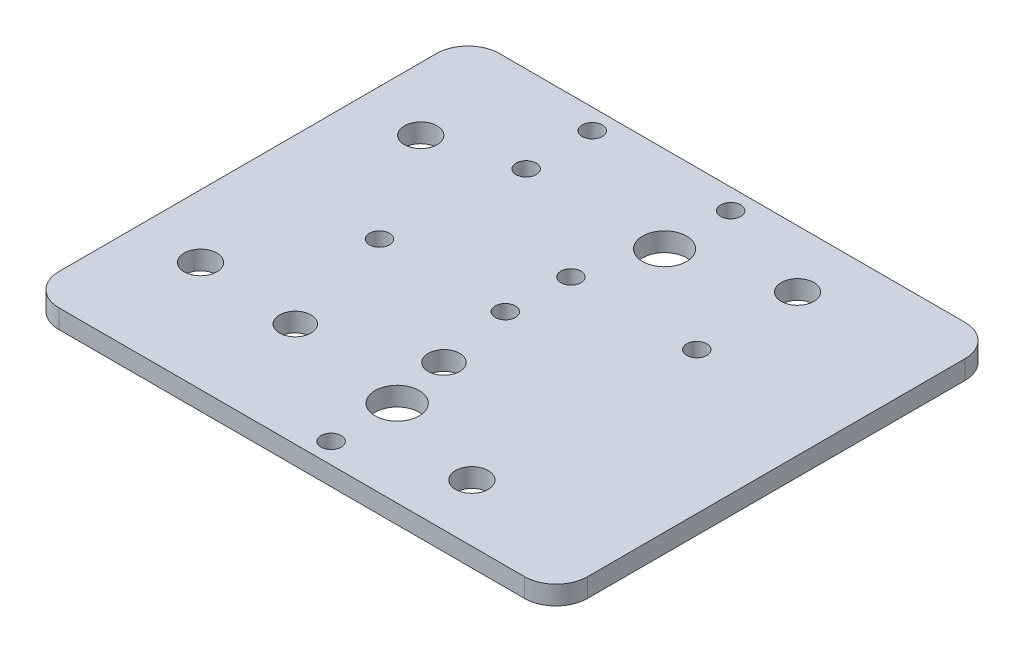
ISO-10303-21;
HEADER;
FILE_DESCRIPTION(('STEP AP214'),'2;1');
FILE_NAME('part.step','',(''),(''),'','','');
FILE_SCHEMA(('AUTOMOTIVE_DESIGN { 1 0 10303 214 1 1 1 1 }'));
ENDSEC;
DATA;
#1=APPLICATION_CONTEXT('core data for automotive mechanical design processes');
#2=APPLICATION_PROTOCOL_DEFINITION('international standard','automotive_design',2000,#1);
#3=PRODUCT_CONTEXT('',#1,'mechanical');
#4=PRODUCT('Part','Part','',(#3));
#5=PRODUCT_RELATED_PRODUCT_CATEGORY('part','',(#4));
#6=PRODUCT_DEFINITION_FORMATION('','',#4);
#7=PRODUCT_DEFINITION_CONTEXT('part definition',#1,'design');
#8=PRODUCT_DEFINITION('design','',#6,#7);
#9=PRODUCT_DEFINITION_SHAPE('','',#8);
#10=(LENGTH_UNIT() NAMED_UNIT(*) SI_UNIT(.MILLI.,.METRE.));
#11=(NAMED_UNIT(*) PLANE_ANGLE_UNIT() SI_UNIT($,.RADIAN.));
#12=(NAMED_UNIT(*) SI_UNIT($,.STERADIAN.) SOLID_ANGLE_UNIT());
#13=UNCERTAINTY_MEASURE_WITH_UNIT(LENGTH_MEASURE(1.E-05),#10,'distance_accuracy_value','');
#14=(GEOMETRIC_REPRESENTATION_CONTEXT(3) GLOBAL_UNCERTAINTY_ASSIGNED_CONTEXT((#13)) GLOBAL_UNIT_ASSIGNED_CONTEXT((#10,
#11,#12)) REPRESENTATION_CONTEXT('',''));
#15=CARTESIAN_POINT('',(0.,0.,0.));
#16=DIRECTION('',(0.,0.,1.));
#17=DIRECTION('',(1.,0.,0.));
#18=AXIS2_PLACEMENT_3D('',#15,#16,#17);
#19=CARTESIAN_POINT('',(0.,3.,0.));
#20=DIRECTION('',(0.,-1.,0.));
#21=DIRECTION('',(0.,0.,-1.));
#22=AXIS2_PLACEMENT_3D('',#19,#20,#21);
#23=PLANE('',#22);
#24=CARTESIAN_POINT('',(-25.5000000002138,3.,0.0647945311920816));
#25=DIRECTION('',(0.,1.,0.));
#26=DIRECTION('',(0.,0.,1.));
#27=AXIS2_PLACEMENT_3D('',#24,#25,#26);
#28=CIRCLE('',#27,1.6);
#29=CARTESIAN_POINT('',(-25.5000000002138,3.,1.66479453119208));
#30=VERTEX_POINT('',#29);
#31=EDGE_CURVE('E317',#30,#30,#28,.T.);
#32=ORIENTED_EDGE('',*,*,#31,.F.);
#33=EDGE_LOOP('',(#32));
#34=FACE_BOUND('',#33,.T.);
#35=CARTESIAN_POINT('',(-25.066035849547,3.,-9.93520546880806));
#36=DIRECTION('',(0.,1.,0.));
#37=DIRECTION('',(0.,0.,1.));
#38=AXIS2_PLACEMENT_3D('',#35,#36,#37);
#39=CIRCLE('',#38,1.6);
#40=CARTESIAN_POINT('',(-25.066035849547,3.,-8.33520546880806));
#41=VERTEX_POINT('',#40);
#42=EDGE_CURVE('E311',#41,#41,#39,.T.);
#43=ORIENTED_EDGE('',*,*,#42,.F.);
#44=EDGE_LOOP('',(#43));
#45=FACE_BOUND('',#44,.T.);
#46=CARTESIAN_POINT('',(-5.00000000019241,3.,25.8790553609461));
#47=DIRECTION('',(0.,1.,0.));
#48=DIRECTION('',(0.,0.,1.));
#49=AXIS2_PLACEMENT_3D('',#46,#47,#48);
#50=CIRCLE('',#49,2.6);
#51=CARTESIAN_POINT('',(-5.00000000019241,3.,28.4790553609461));
#52=VERTEX_POINT('',#51);
#53=EDGE_CURVE('E305',#52,#52,#50,.T.);
#54=ORIENTED_EDGE('',*,*,#53,.F.);
#55=EDGE_LOOP('',(#54));
#56=FACE_BOUND('',#55,.T.);
#57=CARTESIAN_POINT('',(-5.06603584954699,3.,-9.93520546880806));
#58=DIRECTION('',(0.,1.,0.));
#59=DIRECTION('',(0.,0.,1.));
#60=AXIS2_PLACEMENT_3D('',#57,#58,#59);
#61=CIRCLE('',#60,1.6);
#62=CARTESIAN_POINT('',(-5.06603584954699,3.,-8.33520546880806));
#63=VERTEX_POINT('',#62);
#64=EDGE_CURVE('E298',#63,#63,#61,.T.);
#65=ORIENTED_EDGE('',*,*,#64,.F.);
#66=EDGE_LOOP('',(#65));
#67=FACE_BOUND('',#66,.T.);
#68=CARTESIAN_POINT('',(-56.5,3.,-17.5000000000001));
#69=DIRECTION('',(0.,1.,0.));
#70=DIRECTION('',(0.,0.,1.));
#71=AXIS2_PLACEMENT_3D('',#68,#69,#70);
#72=CIRCLE('',#71,2.6);
#73=CARTESIAN_POINT('',(-56.5,3.,-14.9000000000001));
#74=VERTEX_POINT('',#73);
#75=EDGE_CURVE('E334',#74,#74,#72,.T.);
#76=ORIENTED_EDGE('',*,*,#75,.F.);
#77=EDGE_LOOP('',(#76));
#78=FACE_BOUND('',#77,.T.);
#79=CARTESIAN_POINT('',(-5.00000000019241,3.,-25.8790553609461));
#80=DIRECTION('',(0.,1.,0.));
#81=DIRECTION('',(0.,0.,1.));
#82=AXIS2_PLACEMENT_3D('',#79,#80,#81);
#83=CIRCLE('',#82,2.6);
#84=CARTESIAN_POINT('',(-5.00000000019241,3.,-23.2790553609461));
#85=VERTEX_POINT('',#84);
#86=EDGE_CURVE('E328',#85,#85,#83,.T.);
#87=ORIENTED_EDGE('',*,*,#86,.F.);
#88=EDGE_LOOP('',(#87));
#89=FACE_BOUND('',#88,.T.);
#90=CARTESIAN_POINT('',(-56.5,3.,17.5000000000001));
#91=DIRECTION('',(0.,1.,0.));
#92=DIRECTION('',(0.,0.,1.));
#93=AXIS2_PLACEMENT_3D('',#90,#91,#92);
#94=CIRCLE('',#93,2.6);
#95=CARTESIAN_POINT('',(-56.5,3.,20.1000000000001));
#96=VERTEX_POINT('',#95);
#97=EDGE_CURVE('E322',#96,#96,#94,.T.);
#98=ORIENTED_EDGE('',*,*,#97,.F.);
#99=EDGE_LOOP('',(#98));
#100=FACE_BOUND('',#99,.T.);
#101=CARTESIAN_POINT('',(-45.5000000002138,3.,0.064794531192105));
#102=DIRECTION('',(0.,1.,0.));
#103=DIRECTION('',(0.,0.,1.));
#104=AXIS2_PLACEMENT_3D('',#101,#102,#103);
#105=CIRCLE('',#104,1.6);
#106=CARTESIAN_POINT('',(-45.5000000002138,3.,1.6647945311921));
#107=VERTEX_POINT('',#106);
#108=EDGE_CURVE('E292',#107,#107,#105,.T.);
#109=ORIENTED_EDGE('',*,*,#108,.F.);
#110=EDGE_LOOP('',(#109));
#111=FACE_BOUND('',#110,.T.);
#112=CARTESIAN_POINT('',(-40.5000000000026,3.,18.4480525361965));
#113=DIRECTION('',(0.,1.,0.));
#114=DIRECTION('',(0.,0.,1.));
#115=AXIS2_PLACEMENT_3D('',#112,#113,#114);
#116=CIRCLE('',#115,2.49999999996961);
#117=CARTESIAN_POINT('',(-40.5000000000026,3.,20.9480525361661));
#118=VERTEX_POINT('',#117);
#119=EDGE_CURVE('E286',#118,#118,#116,.T.);
#120=ORIENTED_EDGE('',*,*,#119,.F.);
#121=EDGE_LOOP('',(#120));
#122=FACE_BOUND('',#121,.T.);
#123=CARTESIAN_POINT('',(-23.3936515938965,3.,11.9198305394652));
#124=DIRECTION('',(0.,1.,0.));
#125=DIRECTION('',(0.,0.,1.));
#126=AXIS2_PLACEMENT_3D('',#123,#124,#125);
#127=CIRCLE('',#126,2.5);
#128=CARTESIAN_POINT('',(-23.3936515938965,3.,14.4198305394652));
#129=VERTEX_POINT('',#128);
#130=EDGE_CURVE('E280',#129,#129,#127,.T.);
#131=ORIENTED_EDGE('',*,*,#130,.F.);
#132=EDGE_LOOP('',(#131));
#133=FACE_BOUND('',#132,.T.);
#134=CARTESIAN_POINT('',(-21.5000000000002,3.,31.75));
#135=DIRECTION('',(0.,-1.,0.));
#136=DIRECTION('',(0.,0.,-1.));
#137=AXIS2_PLACEMENT_3D('',#134,#135,#136);
#138=CIRCLE('',#137,1.6);
#139=CARTESIAN_POINT('',(-21.5000000000002,3.,30.15));
#140=VERTEX_POINT('',#139);
#141=EDGE_CURVE('E171',#140,#140,#138,.T.);
#142=ORIENTED_EDGE('',*,*,#141,.T.);
#143=EDGE_LOOP('',(#142));
#144=FACE_BOUND('',#143,.T.);
#145=CARTESIAN_POINT('',(-43.5000000000002,3.,-21.25));
#146=DIRECTION('',(0.,-1.,0.));
#147=DIRECTION('',(0.,0.,1.));
#148=AXIS2_PLACEMENT_3D('',#145,#146,#147);
#149=CIRCLE('',#148,1.6);
#150=CARTESIAN_POINT('',(-43.5000000000002,3.,-19.65));
#151=VERTEX_POINT('',#150);
#152=EDGE_CURVE('E260',#151,#151,#149,.T.);
#153=ORIENTED_EDGE('',*,*,#152,.T.);
#154=EDGE_LOOP('',(#153));
#155=FACE_BOUND('',#154,.T.);
#156=CARTESIAN_POINT('',(-21.5000000000002,3.,-31.75));
#157=DIRECTION('',(0.,-1.,0.));
#158=DIRECTION('',(0.,0.,1.));
#159=AXIS2_PLACEMENT_3D('',#156,#157,#158);
#160=CIRCLE('',#159,1.6);
#161=CARTESIAN_POINT('',(-21.5000000000002,3.,-30.15));
#162=VERTEX_POINT('',#161);
#163=EDGE_CURVE('E246',#162,#162,#160,.T.);
#164=ORIENTED_EDGE('',*,*,#163,.T.);
#165=EDGE_LOOP('',(#164));
#166=FACE_BOUND('',#165,.T.);
#167=CARTESIAN_POINT('',(-21.5000000000002,3.,-21.25));
#168=DIRECTION('',(0.,-1.,0.));
#169=DIRECTION('',(0.,0.,1.));
#170=AXIS2_PLACEMENT_3D('',#167,#168,#169);
#171=CIRCLE('',#170,3.5);
#172=CARTESIAN_POINT('',(-21.5000000000002,3.,-17.75));
#173=VERTEX_POINT('',#172);
#174=EDGE_CURVE('E269',#173,#173,#171,.T.);
#175=ORIENTED_EDGE('',*,*,#174,.T.);
#176=EDGE_LOOP('',(#175));
#177=FACE_BOUND('',#176,.T.);
#178=CARTESIAN_POINT('',(-21.5000000000002,3.,21.25));
#179=DIRECTION('',(0.,-1.,0.));
#180=DIRECTION('',(0.,0.,-1.));
#181=AXIS2_PLACEMENT_3D('',#178,#179,#180);
#182=CIRCLE('',#181,3.5);
#183=CARTESIAN_POINT('',(-21.5000000000002,3.,17.75));
#184=VERTEX_POINT('',#183);
#185=EDGE_CURVE('E268',#184,#184,#182,.T.);
#186=ORIENTED_EDGE('',*,*,#185,.T.);
#187=EDGE_LOOP('',(#186));
#188=FACE_BOUND('',#187,.T.);
#189=CARTESIAN_POINT('',(-43.5000000000002,3.,-31.75));
#190=DIRECTION('',(0.,-1.,0.));
#191=DIRECTION('',(0.,0.,-1.));
#192=AXIS2_PLACEMENT_3D('',#189,#190,#191);
#193=CIRCLE('',#192,1.60000000000001);
#194=CARTESIAN_POINT('',(-43.5000000000002,3.,-33.35));
#195=VERTEX_POINT('',#194);
#196=EDGE_CURVE('E251',#195,#195,#193,.T.);
#197=ORIENTED_EDGE('',*,*,#196,.T.);
#198=EDGE_LOOP('',(#197));
#199=FACE_BOUND('',#198,.T.);
#200=DIRECTION('',(0.,0.,-1.));
#201=VECTOR('',#200,1.);
#202=CARTESIAN_POINT('',(17.5,3.,35.));
#203=LINE('',#202,#201);
#204=CARTESIAN_POINT('',(17.5,3.,30.));
#205=VERTEX_POINT('',#204);
#206=CARTESIAN_POINT('',(17.5,3.,-30.));
#207=VERTEX_POINT('',#206);
#208=EDGE_CURVE('E132',#205,#207,#203,.T.);
#209=ORIENTED_EDGE('',*,*,#208,.T.);
#210=CARTESIAN_POINT('',(12.5,3.,-30.));
#211=DIRECTION('',(0.,-1.,0.));
#212=DIRECTION('',(0.,0.,-1.));
#213=AXIS2_PLACEMENT_3D('',#210,#211,#212);
#214=CIRCLE('',#213,5.);
#215=CARTESIAN_POINT('',(12.5,3.,-35.));
#216=VERTEX_POINT('',#215);
#217=EDGE_CURVE('E152',#207,#216,#214,.F.);
#218=ORIENTED_EDGE('',*,*,#217,.T.);
#219=DIRECTION('',(-1.,0.,0.));
#220=VECTOR('',#219,1.);
#221=CARTESIAN_POINT('',(-17.5,3.,-35.));
#222=LINE('',#221,#220);
#223=CARTESIAN_POINT('',(-61.5,3.,-35.));
#224=VERTEX_POINT('',#223);
#225=EDGE_CURVE('E122',#216,#224,#222,.T.);
#226=ORIENTED_EDGE('',*,*,#225,.T.);
#227=CARTESIAN_POINT('',(-61.5,3.,-30.));
#228=DIRECTION('',(0.,-1.,0.));
#229=DIRECTION('',(0.,0.,-1.));
#230=AXIS2_PLACEMENT_3D('',#227,#228,#229);
#231=CIRCLE('',#230,5.);
#232=CARTESIAN_POINT('',(-66.5,3.,-30.));
#233=VERTEX_POINT('',#232);
#234=EDGE_CURVE('E150',#224,#233,#231,.F.);
#235=ORIENTED_EDGE('',*,*,#234,.T.);
#236=DIRECTION('',(0.,0.,1.));
#237=VECTOR('',#236,1.);
#238=CARTESIAN_POINT('',(-66.5,3.,35.));
#239=LINE('',#238,#237);
#240=CARTESIAN_POINT('',(-66.5,3.,30.));
#241=VERTEX_POINT('',#240);
#242=EDGE_CURVE('E168',#233,#241,#239,.T.);
#243=ORIENTED_EDGE('',*,*,#242,.T.);
#244=CARTESIAN_POINT('',(-61.5,3.,30.));
#245=DIRECTION('',(0.,-1.,0.));
#246=DIRECTION('',(0.,0.,-1.));
#247=AXIS2_PLACEMENT_3D('',#244,#245,#246);
#248=CIRCLE('',#247,5.);
#249=CARTESIAN_POINT('',(-61.5,3.,35.));
#250=VERTEX_POINT('',#249);
#251=EDGE_CURVE('E57',#241,#250,#248,.F.);
#252=ORIENTED_EDGE('',*,*,#251,.T.);
#253=DIRECTION('',(1.,0.,0.));
#254=VECTOR('',#253,1.);
#255=CARTESIAN_POINT('',(-17.5,3.,35.));
#256=LINE('',#255,#254);
#257=CARTESIAN_POINT('',(12.5,3.,35.));
#258=VERTEX_POINT('',#257);
#259=EDGE_CURVE('E138',#250,#258,#256,.T.);
#260=ORIENTED_EDGE('',*,*,#259,.T.);
#261=CARTESIAN_POINT('',(12.5,3.,30.));
#262=DIRECTION('',(0.,-1.,0.));
#263=DIRECTION('',(0.,0.,-1.));
#264=AXIS2_PLACEMENT_3D('',#261,#262,#263);
#265=CIRCLE('',#264,5.);
#266=EDGE_CURVE('E148',#258,#205,#265,.F.);
#267=ORIENTED_EDGE('',*,*,#266,.T.);
#268=EDGE_LOOP('',(#209,#218,#226,#235,#243,#252,#260,#267));
#269=FACE_BOUND('',#268,.T.);
#270=ADVANCED_FACE('F37',(#34,#45,#56,#67,#78,#89,#100,#111,#122,#133,#144,#155,#166,#177,#188,
#199,#269),#23,.F.);
#271=CARTESIAN_POINT('',(0.,0.,0.));
#272=DIRECTION('',(0.,-1.,0.));
#273=DIRECTION('',(0.,0.,-1.));
#274=AXIS2_PLACEMENT_3D('',#271,#272,#273);
#275=PLANE('',#274);
#276=CARTESIAN_POINT('',(-25.5000000002138,0.,0.0647945311920816));
#277=DIRECTION('',(0.,1.,0.));
#278=DIRECTION('',(0.,0.,1.));
#279=AXIS2_PLACEMENT_3D('',#276,#277,#278);
#280=CIRCLE('',#279,1.6);
#281=CARTESIAN_POINT('',(-25.5000000002138,0.,1.66479453119208));
#282=VERTEX_POINT('',#281);
#283=EDGE_CURVE('E295',#282,#282,#280,.T.);
#284=ORIENTED_EDGE('',*,*,#283,.T.);
#285=EDGE_LOOP('',(#284));
#286=FACE_BOUND('',#285,.T.);
#287=CARTESIAN_POINT('',(-25.066035849547,0.,-9.93520546880806));
#288=DIRECTION('',(0.,1.,0.));
#289=DIRECTION('',(0.,0.,1.));
#290=AXIS2_PLACEMENT_3D('',#287,#288,#289);
#291=CIRCLE('',#290,1.6);
#292=CARTESIAN_POINT('',(-25.066035849547,0.,-8.33520546880806));
#293=VERTEX_POINT('',#292);
#294=EDGE_CURVE('E314',#293,#293,#291,.T.);
#295=ORIENTED_EDGE('',*,*,#294,.T.);
#296=EDGE_LOOP('',(#295));
#297=FACE_BOUND('',#296,.T.);
#298=CARTESIAN_POINT('',(-5.00000000019241,0.,25.8790553609461));
#299=DIRECTION('',(0.,1.,0.));
#300=DIRECTION('',(0.,0.,1.));
#301=AXIS2_PLACEMENT_3D('',#298,#299,#300);
#302=CIRCLE('',#301,2.6);
#303=CARTESIAN_POINT('',(-5.00000000019241,0.,28.4790553609461));
#304=VERTEX_POINT('',#303);
#305=EDGE_CURVE('E308',#304,#304,#302,.T.);
#306=ORIENTED_EDGE('',*,*,#305,.T.);
#307=EDGE_LOOP('',(#306));
#308=FACE_BOUND('',#307,.T.);
#309=CARTESIAN_POINT('',(-5.06603584954699,0.,-9.93520546880806));
#310=DIRECTION('',(0.,1.,0.));
#311=DIRECTION('',(0.,0.,1.));
#312=AXIS2_PLACEMENT_3D('',#309,#310,#311);
#313=CIRCLE('',#312,1.6);
#314=CARTESIAN_POINT('',(-5.06603584954699,0.,-8.33520546880806));
#315=VERTEX_POINT('',#314);
#316=EDGE_CURVE('E301',#315,#315,#313,.T.);
#317=ORIENTED_EDGE('',*,*,#316,.T.);
#318=EDGE_LOOP('',(#317));
#319=FACE_BOUND('',#318,.T.);
#320=CARTESIAN_POINT('',(-56.5,0.,-17.5000000000001));
#321=DIRECTION('',(0.,1.,0.));
#322=DIRECTION('',(0.,0.,1.));
#323=AXIS2_PLACEMENT_3D('',#320,#321,#322);
#324=CIRCLE('',#323,2.6);
#325=CARTESIAN_POINT('',(-56.5,0.,-14.9000000000001));
#326=VERTEX_POINT('',#325);
#327=EDGE_CURVE('E302',#326,#326,#324,.T.);
#328=ORIENTED_EDGE('',*,*,#327,.T.);
#329=EDGE_LOOP('',(#328));
#330=FACE_BOUND('',#329,.T.);
#331=CARTESIAN_POINT('',(-5.00000000019241,0.,-25.8790553609461));
#332=DIRECTION('',(0.,1.,0.));
#333=DIRECTION('',(0.,0.,1.));
#334=AXIS2_PLACEMENT_3D('',#331,#332,#333);
#335=CIRCLE('',#334,2.6);
#336=CARTESIAN_POINT('',(-5.00000000019241,0.,-23.2790553609461));
#337=VERTEX_POINT('',#336);
#338=EDGE_CURVE('E331',#337,#337,#335,.T.);
#339=ORIENTED_EDGE('',*,*,#338,.T.);
#340=EDGE_LOOP('',(#339));
#341=FACE_BOUND('',#340,.T.);
#342=CARTESIAN_POINT('',(-56.5,0.,17.5000000000001));
#343=DIRECTION('',(0.,1.,0.));
#344=DIRECTION('',(0.,0.,1.));
#345=AXIS2_PLACEMENT_3D('',#342,#343,#344);
#346=CIRCLE('',#345,2.6);
#347=CARTESIAN_POINT('',(-56.5,0.,20.1000000000001));
#348=VERTEX_POINT('',#347);
#349=EDGE_CURVE('E325',#348,#348,#346,.T.);
#350=ORIENTED_EDGE('',*,*,#349,.T.);
#351=EDGE_LOOP('',(#350));
#352=FACE_BOUND('',#351,.T.);
#353=CARTESIAN_POINT('',(-45.5000000002138,0.,0.064794531192105));
#354=DIRECTION('',(0.,1.,0.));
#355=DIRECTION('',(0.,0.,1.));
#356=AXIS2_PLACEMENT_3D('',#353,#354,#355);
#357=CIRCLE('',#356,1.6);
#358=CARTESIAN_POINT('',(-45.5000000002138,0.,1.6647945311921));
#359=VERTEX_POINT('',#358);
#360=EDGE_CURVE('E289',#359,#359,#357,.T.);
#361=ORIENTED_EDGE('',*,*,#360,.T.);
#362=EDGE_LOOP('',(#361));
#363=FACE_BOUND('',#362,.T.);
#364=CARTESIAN_POINT('',(-40.5000000000026,0.,18.4480525361965));
#365=DIRECTION('',(0.,1.,0.));
#366=DIRECTION('',(0.,0.,1.));
#367=AXIS2_PLACEMENT_3D('',#364,#365,#366);
#368=CIRCLE('',#367,2.49999999996961);
#369=CARTESIAN_POINT('',(-40.5000000000026,0.,20.9480525361661));
#370=VERTEX_POINT('',#369);
#371=EDGE_CURVE('E283',#370,#370,#368,.T.);
#372=ORIENTED_EDGE('',*,*,#371,.T.);
#373=EDGE_LOOP('',(#372));
#374=FACE_BOUND('',#373,.T.);
#375=CARTESIAN_POINT('',(-23.3936515938965,0.,11.9198305394652));
#376=DIRECTION('',(0.,1.,0.));
#377=DIRECTION('',(0.,0.,1.));
#378=AXIS2_PLACEMENT_3D('',#375,#376,#377);
#379=CIRCLE('',#378,2.5);
#380=CARTESIAN_POINT('',(-23.3936515938965,0.,14.4198305394652));
#381=VERTEX_POINT('',#380);
#382=EDGE_CURVE('E277',#381,#381,#379,.T.);
#383=ORIENTED_EDGE('',*,*,#382,.T.);
#384=EDGE_LOOP('',(#383));
#385=FACE_BOUND('',#384,.T.);
#386=CARTESIAN_POINT('',(-21.5000000000002,0.,31.75));
#387=DIRECTION('',(0.,-1.,0.));
#388=DIRECTION('',(0.,0.,-1.));
#389=AXIS2_PLACEMENT_3D('',#386,#387,#388);
#390=CIRCLE('',#389,1.6);
#391=CARTESIAN_POINT('',(-21.5000000000002,0.,30.15));
#392=VERTEX_POINT('',#391);
#393=EDGE_CURVE('E175',#392,#392,#390,.T.);
#394=ORIENTED_EDGE('',*,*,#393,.F.);
#395=EDGE_LOOP('',(#394));
#396=FACE_BOUND('',#395,.T.);
#397=CARTESIAN_POINT('',(-43.5000000000002,0.,-21.25));
#398=DIRECTION('',(0.,-1.,0.));
#399=DIRECTION('',(0.,0.,1.));
#400=AXIS2_PLACEMENT_3D('',#397,#398,#399);
#401=CIRCLE('',#400,1.6);
#402=CARTESIAN_POINT('',(-43.5000000000002,0.,-19.65));
#403=VERTEX_POINT('',#402);
#404=EDGE_CURVE('E252',#403,#403,#401,.T.);
#405=ORIENTED_EDGE('',*,*,#404,.F.);
#406=EDGE_LOOP('',(#405));
#407=FACE_BOUND('',#406,.T.);
#408=CARTESIAN_POINT('',(-21.5000000000002,0.,-31.75));
#409=DIRECTION('',(0.,-1.,0.));
#410=DIRECTION('',(0.,0.,1.));
#411=AXIS2_PLACEMENT_3D('',#408,#409,#410);
#412=CIRCLE('',#411,1.6);
#413=CARTESIAN_POINT('',(-21.5000000000002,0.,-30.15));
#414=VERTEX_POINT('',#413);
#415=EDGE_CURVE('E249',#414,#414,#412,.T.);
#416=ORIENTED_EDGE('',*,*,#415,.F.);
#417=EDGE_LOOP('',(#416));
#418=FACE_BOUND('',#417,.T.);
#419=CARTESIAN_POINT('',(-21.5000000000002,0.,-21.25));
#420=DIRECTION('',(0.,-1.,0.));
#421=DIRECTION('',(0.,0.,1.));
#422=AXIS2_PLACEMENT_3D('',#419,#420,#421);
#423=CIRCLE('',#422,3.5);
#424=CARTESIAN_POINT('',(-21.5000000000002,0.,-17.75));
#425=VERTEX_POINT('',#424);
#426=EDGE_CURVE('E274',#425,#425,#423,.T.);
#427=ORIENTED_EDGE('',*,*,#426,.F.);
#428=EDGE_LOOP('',(#427));
#429=FACE_BOUND('',#428,.T.);
#430=CARTESIAN_POINT('',(-21.5000000000002,0.,21.25));
#431=DIRECTION('',(0.,-1.,0.));
#432=DIRECTION('',(0.,0.,-1.));
#433=AXIS2_PLACEMENT_3D('',#430,#431,#432);
#434=CIRCLE('',#433,3.5);
#435=CARTESIAN_POINT('',(-21.5000000000002,0.,17.75));
#436=VERTEX_POINT('',#435);
#437=EDGE_CURVE('E265',#436,#436,#434,.T.);
#438=ORIENTED_EDGE('',*,*,#437,.F.);
#439=EDGE_LOOP('',(#438));
#440=FACE_BOUND('',#439,.T.);
#441=CARTESIAN_POINT('',(-43.5000000000002,0.,-31.75));
#442=DIRECTION('',(0.,-1.,0.));
#443=DIRECTION('',(0.,0.,-1.));
#444=AXIS2_PLACEMENT_3D('',#441,#442,#443);
#445=CIRCLE('',#444,1.60000000000001);
#446=CARTESIAN_POINT('',(-43.5000000000002,0.,-33.35));
#447=VERTEX_POINT('',#446);
#448=EDGE_CURVE('E255',#447,#447,#445,.T.);
#449=ORIENTED_EDGE('',*,*,#448,.F.);
#450=EDGE_LOOP('',(#449));
#451=FACE_BOUND('',#450,.T.);
#452=DIRECTION('',(-1.,0.,0.));
#453=VECTOR('',#452,1.);
#454=CARTESIAN_POINT('',(-17.5,0.,-35.));
#455=LINE('',#454,#453);
#456=CARTESIAN_POINT('',(12.5,0.,-35.));
#457=VERTEX_POINT('',#456);
#458=CARTESIAN_POINT('',(-61.5,0.,-35.));
#459=VERTEX_POINT('',#458);
#460=EDGE_CURVE('E119',#457,#459,#455,.T.);
#461=ORIENTED_EDGE('',*,*,#460,.F.);
#462=CARTESIAN_POINT('',(12.5,0.,-30.));
#463=DIRECTION('',(0.,-1.,0.));
#464=DIRECTION('',(0.,0.,-1.));
#465=AXIS2_PLACEMENT_3D('',#462,#463,#464);
#466=CIRCLE('',#465,5.);
#467=CARTESIAN_POINT('',(17.5,0.,-30.));
#468=VERTEX_POINT('',#467);
#469=EDGE_CURVE('E101',#457,#468,#466,.T.);
#470=ORIENTED_EDGE('',*,*,#469,.T.);
#471=DIRECTION('',(0.,0.,-1.));
#472=VECTOR('',#471,1.);
#473=CARTESIAN_POINT('',(17.5,0.,35.));
#474=LINE('',#473,#472);
#475=CARTESIAN_POINT('',(17.5,0.,30.));
#476=VERTEX_POINT('',#475);
#477=EDGE_CURVE('E130',#476,#468,#474,.T.);
#478=ORIENTED_EDGE('',*,*,#477,.F.);
#479=CARTESIAN_POINT('',(12.5,0.,30.));
#480=DIRECTION('',(0.,-1.,0.));
#481=DIRECTION('',(0.,0.,-1.));
#482=AXIS2_PLACEMENT_3D('',#479,#480,#481);
#483=CIRCLE('',#482,5.);
#484=CARTESIAN_POINT('',(12.5,0.,35.));
#485=VERTEX_POINT('',#484);
#486=EDGE_CURVE('E141',#476,#485,#483,.T.);
#487=ORIENTED_EDGE('',*,*,#486,.T.);
#488=DIRECTION('',(1.,0.,0.));
#489=VECTOR('',#488,1.);
#490=CARTESIAN_POINT('',(-17.5,0.,35.));
#491=LINE('',#490,#489);
#492=CARTESIAN_POINT('',(-61.5,0.,35.));
#493=VERTEX_POINT('',#492);
#494=EDGE_CURVE('E129',#493,#485,#491,.T.);
#495=ORIENTED_EDGE('',*,*,#494,.F.);
#496=CARTESIAN_POINT('',(-61.5,0.,30.));
#497=DIRECTION('',(0.,-1.,0.));
#498=DIRECTION('',(0.,0.,-1.));
#499=AXIS2_PLACEMENT_3D('',#496,#497,#498);
#500=CIRCLE('',#499,5.);
#501=CARTESIAN_POINT('',(-66.5,0.,30.));
#502=VERTEX_POINT('',#501);
#503=EDGE_CURVE('E123',#493,#502,#500,.T.);
#504=ORIENTED_EDGE('',*,*,#503,.T.);
#505=DIRECTION('',(0.,0.,1.));
#506=VECTOR('',#505,1.);
#507=CARTESIAN_POINT('',(-66.5,0.,35.));
#508=LINE('',#507,#506);
#509=CARTESIAN_POINT('',(-66.5,0.,-30.));
#510=VERTEX_POINT('',#509);
#511=EDGE_CURVE('E134',#510,#502,#508,.T.);
#512=ORIENTED_EDGE('',*,*,#511,.F.);
#513=CARTESIAN_POINT('',(-61.5,0.,-30.));
#514=DIRECTION('',(0.,-1.,0.));
#515=DIRECTION('',(0.,0.,-1.));
#516=AXIS2_PLACEMENT_3D('',#513,#514,#515);
#517=CIRCLE('',#516,5.);
#518=EDGE_CURVE('E112',#510,#459,#517,.T.);
#519=ORIENTED_EDGE('',*,*,#518,.T.);
#520=EDGE_LOOP('',(#461,#470,#478,#487,#495,#504,#512,#519));
#521=FACE_BOUND('',#520,.T.);
#522=ADVANCED_FACE('F126',(#286,#297,#308,#319,#330,#341,#352,#363,#374,#385,#396,#407,#418,
#429,#440,#451,#521),#275,.T.);
#523=CARTESIAN_POINT('',(17.5,3.,35.));
#524=DIRECTION('',(-1.,0.,0.));
#525=DIRECTION('',(0.,0.,1.));
#526=AXIS2_PLACEMENT_3D('',#523,#524,#525);
#527=PLANE('',#526);
#528=ORIENTED_EDGE('',*,*,#477,.T.);
#529=DIRECTION('',(0.,-1.,0.));
#530=VECTOR('',#529,1.);
#531=CARTESIAN_POINT('',(17.5,3.,-30.));
#532=LINE('',#531,#530);
#533=EDGE_CURVE('E106',#468,#207,#532,.F.);
#534=ORIENTED_EDGE('',*,*,#533,.T.);
#535=ORIENTED_EDGE('',*,*,#208,.F.);
#536=DIRECTION('',(0.,-1.,0.));
#537=VECTOR('',#536,1.);
#538=CARTESIAN_POINT('',(17.5,3.,30.));
#539=LINE('',#538,#537);
#540=EDGE_CURVE('E111',#205,#476,#539,.T.);
#541=ORIENTED_EDGE('',*,*,#540,.T.);
#542=EDGE_LOOP('',(#528,#534,#535,#541));
#543=FACE_BOUND('',#542,.T.);
#544=ADVANCED_FACE('F186',(#543),#527,.F.);
#545=CARTESIAN_POINT('',(-17.5,3.,-35.));
#546=DIRECTION('',(0.,0.,1.));
#547=DIRECTION('',(1.,0.,0.));
#548=AXIS2_PLACEMENT_3D('',#545,#546,#547);
#549=PLANE('',#548);
#550=ORIENTED_EDGE('',*,*,#225,.F.);
#551=DIRECTION('',(0.,-1.,0.));
#552=VECTOR('',#551,1.);
#553=CARTESIAN_POINT('',(12.5,3.,-35.));
#554=LINE('',#553,#552);
#555=EDGE_CURVE('E105',#216,#457,#554,.T.);
#556=ORIENTED_EDGE('',*,*,#555,.T.);
#557=ORIENTED_EDGE('',*,*,#460,.T.);
#558=DIRECTION('',(0.,1.,0.));
#559=VECTOR('',#558,1.);
#560=CARTESIAN_POINT('',(-61.5,3.,-35.));
#561=LINE('',#560,#559);
#562=EDGE_CURVE('E124',#459,#224,#561,.T.);
#563=ORIENTED_EDGE('',*,*,#562,.T.);
#564=EDGE_LOOP('',(#550,#556,#557,#563));
#565=FACE_BOUND('',#564,.T.);
#566=ADVANCED_FACE('F117',(#565),#549,.F.);
#567=CARTESIAN_POINT('',(-17.5,3.,35.));
#568=DIRECTION('',(0.,0.,-1.));
#569=DIRECTION('',(-1.,0.,0.));
#570=AXIS2_PLACEMENT_3D('',#567,#568,#569);
#571=PLANE('',#570);
#572=ORIENTED_EDGE('',*,*,#494,.T.);
#573=DIRECTION('',(0.,-1.,0.));
#574=VECTOR('',#573,1.);
#575=CARTESIAN_POINT('',(12.5,3.,35.));
#576=LINE('',#575,#574);
#577=EDGE_CURVE('E11',#485,#258,#576,.F.);
#578=ORIENTED_EDGE('',*,*,#577,.T.);
#579=ORIENTED_EDGE('',*,*,#259,.F.);
#580=DIRECTION('',(0.,1.,0.));
#581=VECTOR('',#580,1.);
#582=CARTESIAN_POINT('',(-61.5,0.,35.));
#583=LINE('',#582,#581);
#584=EDGE_CURVE('E45',#250,#493,#583,.F.);
#585=ORIENTED_EDGE('',*,*,#584,.T.);
#586=EDGE_LOOP('',(#572,#578,#579,#585));
#587=FACE_BOUND('',#586,.T.);
#588=ADVANCED_FACE('F160',(#587),#571,.F.);
#589=CARTESIAN_POINT('',(-66.5,0.,35.));
#590=DIRECTION('',(-1.,0.,0.));
#591=DIRECTION('',(0.,0.,1.));
#592=AXIS2_PLACEMENT_3D('',#589,#590,#591);
#593=PLANE('',#592);
#594=ORIENTED_EDGE('',*,*,#242,.F.);
#595=DIRECTION('',(0.,1.,0.));
#596=VECTOR('',#595,1.);
#597=CARTESIAN_POINT('',(-66.5,0.,-30.));
#598=LINE('',#597,#596);
#599=EDGE_CURVE('E157',#233,#510,#598,.F.);
#600=ORIENTED_EDGE('',*,*,#599,.T.);
#601=ORIENTED_EDGE('',*,*,#511,.T.);
#602=DIRECTION('',(0.,1.,0.));
#603=VECTOR('',#602,1.);
#604=CARTESIAN_POINT('',(-66.5,3.,30.));
#605=LINE('',#604,#603);
#606=EDGE_CURVE('E154',#502,#241,#605,.T.);
#607=ORIENTED_EDGE('',*,*,#606,.T.);
#608=EDGE_LOOP('',(#594,#600,#601,#607));
#609=FACE_BOUND('',#608,.T.);
#610=ADVANCED_FACE('F167',(#609),#593,.T.);
#611=CARTESIAN_POINT('',(-43.5000000000002,3.,-31.75));
#612=DIRECTION('',(0.,-1.,0.));
#613=DIRECTION('',(0.,0.,-1.));
#614=AXIS2_PLACEMENT_3D('',#611,#612,#613);
#615=CYLINDRICAL_SURFACE('',#614,1.60000000000001);
#616=ORIENTED_EDGE('',*,*,#196,.F.);
#617=EDGE_LOOP('',(#616));
#618=FACE_BOUND('',#617,.T.);
#619=ORIENTED_EDGE('',*,*,#448,.T.);
#620=EDGE_LOOP('',(#619));
#621=FACE_BOUND('',#620,.T.);
#622=ADVANCED_FACE('F211',(#618,#621),#615,.F.);
#623=CARTESIAN_POINT('',(-21.5000000000002,3.,21.25));
#624=DIRECTION('',(0.,-1.,0.));
#625=DIRECTION('',(0.,0.,-1.));
#626=AXIS2_PLACEMENT_3D('',#623,#624,#625);
#627=CYLINDRICAL_SURFACE('',#626,3.5);
#628=ORIENTED_EDGE('',*,*,#185,.F.);
#629=EDGE_LOOP('',(#628));
#630=FACE_BOUND('',#629,.T.);
#631=ORIENTED_EDGE('',*,*,#437,.T.);
#632=EDGE_LOOP('',(#631));
#633=FACE_BOUND('',#632,.T.);
#634=ADVANCED_FACE('F215',(#630,#633),#627,.F.);
#635=CARTESIAN_POINT('',(-21.5000000000002,3.,-21.25));
#636=DIRECTION('',(0.,-1.,0.));
#637=DIRECTION('',(0.,0.,-1.));
#638=AXIS2_PLACEMENT_3D('',#635,#636,#637);
#639=CYLINDRICAL_SURFACE('',#638,3.5);
#640=ORIENTED_EDGE('',*,*,#174,.F.);
#641=EDGE_LOOP('',(#640));
#642=FACE_BOUND('',#641,.T.);
#643=ORIENTED_EDGE('',*,*,#426,.T.);
#644=EDGE_LOOP('',(#643));
#645=FACE_BOUND('',#644,.T.);
#646=ADVANCED_FACE('F221',(#642,#645),#639,.F.);
#647=CARTESIAN_POINT('',(-21.5000000000002,3.,-31.75));
#648=DIRECTION('',(0.,-1.,0.));
#649=DIRECTION('',(0.,0.,-1.));
#650=AXIS2_PLACEMENT_3D('',#647,#648,#649);
#651=CYLINDRICAL_SURFACE('',#650,1.6);
#652=ORIENTED_EDGE('',*,*,#163,.F.);
#653=EDGE_LOOP('',(#652));
#654=FACE_BOUND('',#653,.T.);
#655=ORIENTED_EDGE('',*,*,#415,.T.);
#656=EDGE_LOOP('',(#655));
#657=FACE_BOUND('',#656,.T.);
#658=ADVANCED_FACE('F235',(#654,#657),#651,.F.);
#659=CARTESIAN_POINT('',(-43.5000000000002,3.,-21.25));
#660=DIRECTION('',(0.,-1.,0.));
#661=DIRECTION('',(0.,0.,-1.));
#662=AXIS2_PLACEMENT_3D('',#659,#660,#661);
#663=CYLINDRICAL_SURFACE('',#662,1.6);
#664=ORIENTED_EDGE('',*,*,#152,.F.);
#665=EDGE_LOOP('',(#664));
#666=FACE_BOUND('',#665,.T.);
#667=ORIENTED_EDGE('',*,*,#404,.T.);
#668=EDGE_LOOP('',(#667));
#669=FACE_BOUND('',#668,.T.);
#670=ADVANCED_FACE('F232',(#666,#669),#663,.F.);
#671=CARTESIAN_POINT('',(-21.5000000000002,3.,31.75));
#672=DIRECTION('',(0.,-1.,0.));
#673=DIRECTION('',(0.,0.,-1.));
#674=AXIS2_PLACEMENT_3D('',#671,#672,#673);
#675=CYLINDRICAL_SURFACE('',#674,1.6);
#676=ORIENTED_EDGE('',*,*,#141,.F.);
#677=EDGE_LOOP('',(#676));
#678=FACE_BOUND('',#677,.T.);
#679=ORIENTED_EDGE('',*,*,#393,.T.);
#680=EDGE_LOOP('',(#679));
#681=FACE_BOUND('',#680,.T.);
#682=ADVANCED_FACE('F229',(#678,#681),#675,.F.);
#683=CARTESIAN_POINT('',(12.5,3.,-30.));
#684=DIRECTION('',(0.,-1.,0.));
#685=DIRECTION('',(0.,0.,-1.));
#686=AXIS2_PLACEMENT_3D('',#683,#684,#685);
#687=CYLINDRICAL_SURFACE('',#686,5.);
#688=ORIENTED_EDGE('',*,*,#217,.F.);
#689=ORIENTED_EDGE('',*,*,#533,.F.);
#690=ORIENTED_EDGE('',*,*,#469,.F.);
#691=ORIENTED_EDGE('',*,*,#555,.F.);
#692=EDGE_LOOP('',(#688,#689,#690,#691));
#693=FACE_BOUND('',#692,.T.);
#694=ADVANCED_FACE('F104',(#693),#687,.T.);
#695=CARTESIAN_POINT('',(-61.5,3.,-30.));
#696=DIRECTION('',(0.,-1.,0.));
#697=DIRECTION('',(0.,0.,-1.));
#698=AXIS2_PLACEMENT_3D('',#695,#696,#697);
#699=CYLINDRICAL_SURFACE('',#698,5.);
#700=ORIENTED_EDGE('',*,*,#518,.F.);
#701=ORIENTED_EDGE('',*,*,#599,.F.);
#702=ORIENTED_EDGE('',*,*,#234,.F.);
#703=ORIENTED_EDGE('',*,*,#562,.F.);
#704=EDGE_LOOP('',(#700,#701,#702,#703));
#705=FACE_BOUND('',#704,.T.);
#706=ADVANCED_FACE('F524',(#705),#699,.T.);
#707=CARTESIAN_POINT('',(12.5,3.,30.));
#708=DIRECTION('',(0.,-1.,0.));
#709=DIRECTION('',(0.,0.,-1.));
#710=AXIS2_PLACEMENT_3D('',#707,#708,#709);
#711=CYLINDRICAL_SURFACE('',#710,5.);
#712=ORIENTED_EDGE('',*,*,#266,.F.);
#713=ORIENTED_EDGE('',*,*,#577,.F.);
#714=ORIENTED_EDGE('',*,*,#486,.F.);
#715=ORIENTED_EDGE('',*,*,#540,.F.);
#716=EDGE_LOOP('',(#712,#713,#714,#715));
#717=FACE_BOUND('',#716,.T.);
#718=ADVANCED_FACE('F184',(#717),#711,.T.);
#719=CARTESIAN_POINT('',(-61.5,0.,30.));
#720=DIRECTION('',(0.,-1.,0.));
#721=DIRECTION('',(0.,0.,-1.));
#722=AXIS2_PLACEMENT_3D('',#719,#720,#721);
#723=CYLINDRICAL_SURFACE('',#722,5.);
#724=ORIENTED_EDGE('',*,*,#503,.F.);
#725=ORIENTED_EDGE('',*,*,#584,.F.);
#726=ORIENTED_EDGE('',*,*,#251,.F.);
#727=ORIENTED_EDGE('',*,*,#606,.F.);
#728=EDGE_LOOP('',(#724,#725,#726,#727));
#729=FACE_BOUND('',#728,.T.);
#730=ADVANCED_FACE('F39',(#729),#723,.T.);
#731=CARTESIAN_POINT('',(-23.3936515938965,0.,11.9198305394652));
#732=DIRECTION('',(0.,1.,0.));
#733=DIRECTION('',(0.,0.,1.));
#734=AXIS2_PLACEMENT_3D('',#731,#732,#733);
#735=CYLINDRICAL_SURFACE('',#734,2.5);
#736=ORIENTED_EDGE('',*,*,#382,.F.);
#737=EDGE_LOOP('',(#736));
#738=FACE_BOUND('',#737,.T.);
#739=ORIENTED_EDGE('',*,*,#130,.T.);
#740=EDGE_LOOP('',(#739));
#741=FACE_BOUND('',#740,.T.);
#742=ADVANCED_FACE('F385',(#738,#741),#735,.F.);
#743=CARTESIAN_POINT('',(-40.5000000000026,0.,18.4480525361965));
#744=DIRECTION('',(0.,1.,0.));
#745=DIRECTION('',(0.,0.,1.));
#746=AXIS2_PLACEMENT_3D('',#743,#744,#745);
#747=CYLINDRICAL_SURFACE('',#746,2.49999999996961);
#748=ORIENTED_EDGE('',*,*,#371,.F.);
#749=EDGE_LOOP('',(#748));
#750=FACE_BOUND('',#749,.T.);
#751=ORIENTED_EDGE('',*,*,#119,.T.);
#752=EDGE_LOOP('',(#751));
#753=FACE_BOUND('',#752,.T.);
#754=ADVANCED_FACE('F387',(#750,#753),#747,.F.);
#755=CARTESIAN_POINT('',(-45.5000000002138,0.,0.064794531192105));
#756=DIRECTION('',(0.,1.,0.));
#757=DIRECTION('',(0.,0.,1.));
#758=AXIS2_PLACEMENT_3D('',#755,#756,#757);
#759=CYLINDRICAL_SURFACE('',#758,1.6);
#760=ORIENTED_EDGE('',*,*,#360,.F.);
#761=EDGE_LOOP('',(#760));
#762=FACE_BOUND('',#761,.T.);
#763=ORIENTED_EDGE('',*,*,#108,.T.);
#764=EDGE_LOOP('',(#763));
#765=FACE_BOUND('',#764,.T.);
#766=ADVANCED_FACE('F393',(#762,#765),#759,.F.);
#767=CARTESIAN_POINT('',(-56.5,0.,17.5000000000001));
#768=DIRECTION('',(0.,1.,0.));
#769=DIRECTION('',(0.,0.,1.));
#770=AXIS2_PLACEMENT_3D('',#767,#768,#769);
#771=CYLINDRICAL_SURFACE('',#770,2.6);
#772=ORIENTED_EDGE('',*,*,#349,.F.);
#773=EDGE_LOOP('',(#772));
#774=FACE_BOUND('',#773,.T.);
#775=ORIENTED_EDGE('',*,*,#97,.T.);
#776=EDGE_LOOP('',(#775));
#777=FACE_BOUND('',#776,.T.);
#778=ADVANCED_FACE('F400',(#774,#777),#771,.F.);
#779=CARTESIAN_POINT('',(-5.00000000019241,0.,-25.8790553609461));
#780=DIRECTION('',(0.,1.,0.));
#781=DIRECTION('',(0.,0.,1.));
#782=AXIS2_PLACEMENT_3D('',#779,#780,#781);
#783=CYLINDRICAL_SURFACE('',#782,2.6);
#784=ORIENTED_EDGE('',*,*,#338,.F.);
#785=EDGE_LOOP('',(#784));
#786=FACE_BOUND('',#785,.T.);
#787=ORIENTED_EDGE('',*,*,#86,.T.);
#788=EDGE_LOOP('',(#787));
#789=FACE_BOUND('',#788,.T.);
#790=ADVANCED_FACE('F346',(#786,#789),#783,.F.);
#791=CARTESIAN_POINT('',(-56.5,0.,-17.5000000000001));
#792=DIRECTION('',(0.,1.,0.));
#793=DIRECTION('',(0.,0.,1.));
#794=AXIS2_PLACEMENT_3D('',#791,#792,#793);
#795=CYLINDRICAL_SURFACE('',#794,2.6);
#796=ORIENTED_EDGE('',*,*,#327,.F.);
#797=EDGE_LOOP('',(#796));
#798=FACE_BOUND('',#797,.T.);
#799=ORIENTED_EDGE('',*,*,#75,.T.);
#800=EDGE_LOOP('',(#799));
#801=FACE_BOUND('',#800,.T.);
#802=ADVANCED_FACE('F342',(#798,#801),#795,.F.);
#803=CARTESIAN_POINT('',(-5.06603584954699,0.,-9.93520546880806));
#804=DIRECTION('',(0.,1.,0.));
#805=DIRECTION('',(0.,0.,1.));
#806=AXIS2_PLACEMENT_3D('',#803,#804,#805);
#807=CYLINDRICAL_SURFACE('',#806,1.6);
#808=ORIENTED_EDGE('',*,*,#316,.F.);
#809=EDGE_LOOP('',(#808));
#810=FACE_BOUND('',#809,.T.);
#811=ORIENTED_EDGE('',*,*,#64,.T.);
#812=EDGE_LOOP('',(#811));
#813=FACE_BOUND('',#812,.T.);
#814=ADVANCED_FACE('F345',(#810,#813),#807,.F.);
#815=CARTESIAN_POINT('',(-5.00000000019241,0.,25.8790553609461));
#816=DIRECTION('',(0.,1.,0.));
#817=DIRECTION('',(0.,0.,1.));
#818=AXIS2_PLACEMENT_3D('',#815,#816,#817);
#819=CYLINDRICAL_SURFACE('',#818,2.6);
#820=ORIENTED_EDGE('',*,*,#305,.F.);
#821=EDGE_LOOP('',(#820));
#822=FACE_BOUND('',#821,.T.);
#823=ORIENTED_EDGE('',*,*,#53,.T.);
#824=EDGE_LOOP('',(#823));
#825=FACE_BOUND('',#824,.T.);
#826=ADVANCED_FACE('F404',(#822,#825),#819,.F.);
#827=CARTESIAN_POINT('',(-25.066035849547,0.,-9.93520546880806));
#828=DIRECTION('',(0.,1.,0.));
#829=DIRECTION('',(0.,0.,1.));
#830=AXIS2_PLACEMENT_3D('',#827,#828,#829);
#831=CYLINDRICAL_SURFACE('',#830,1.6);
#832=ORIENTED_EDGE('',*,*,#294,.F.);
#833=EDGE_LOOP('',(#832));
#834=FACE_BOUND('',#833,.T.);
#835=ORIENTED_EDGE('',*,*,#42,.T.);
#836=EDGE_LOOP('',(#835));
#837=FACE_BOUND('',#836,.T.);
#838=ADVANCED_FACE('F408',(#834,#837),#831,.F.);
#839=CARTESIAN_POINT('',(-25.5000000002138,0.,0.0647945311920816));
#840=DIRECTION('',(0.,1.,0.));
#841=DIRECTION('',(0.,0.,1.));
#842=AXIS2_PLACEMENT_3D('',#839,#840,#841);
#843=CYLINDRICAL_SURFACE('',#842,1.6);
#844=ORIENTED_EDGE('',*,*,#283,.F.);
#845=EDGE_LOOP('',(#844));
#846=FACE_BOUND('',#845,.T.);
#847=ORIENTED_EDGE('',*,*,#31,.T.);
#848=EDGE_LOOP('',(#847));
#849=FACE_BOUND('',#848,.T.);
#850=ADVANCED_FACE('F412',(#846,#849),#843,.F.);
#851=CLOSED_SHELL('',(#270,#522,#544,#566,#588,#610,#622,#634,#646,#658,#670,#682,#694,#706,
#718,#730,#742,#754,#766,#778,#790,#802,#814,#826,#838,#850));
#852=MANIFOLD_SOLID_BREP('B2',#851);
#853=ADVANCED_BREP_SHAPE_REPRESENTATION('',(#18,#852),#14);
#854=SHAPE_DEFINITION_REPRESENTATION(#9,#853);
ENDSEC;
END-ISO-10303-21;
